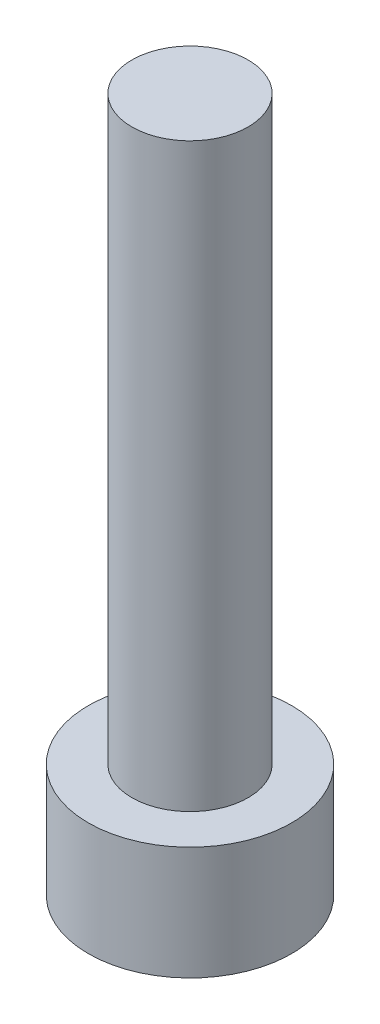
ISO-10303-21;
HEADER;
FILE_DESCRIPTION(('STEP AP214'),'2;1');
FILE_NAME('part.step','',(''),(''),'','','');
FILE_SCHEMA(('AUTOMOTIVE_DESIGN { 1 0 10303 214 1 1 1 1 }'));
ENDSEC;
DATA;
#1=APPLICATION_CONTEXT('core data for automotive mechanical design processes');
#2=APPLICATION_PROTOCOL_DEFINITION('international standard','automotive_design',2000,#1);
#3=PRODUCT_CONTEXT('',#1,'mechanical');
#4=PRODUCT('Part','Part','',(#3));
#5=PRODUCT_RELATED_PRODUCT_CATEGORY('part','',(#4));
#6=PRODUCT_DEFINITION_FORMATION('','',#4);
#7=PRODUCT_DEFINITION_CONTEXT('part definition',#1,'design');
#8=PRODUCT_DEFINITION('design','',#6,#7);
#9=PRODUCT_DEFINITION_SHAPE('','',#8);
#10=(LENGTH_UNIT() NAMED_UNIT(*) SI_UNIT(.MILLI.,.METRE.));
#11=(NAMED_UNIT(*) PLANE_ANGLE_UNIT() SI_UNIT($,.RADIAN.));
#12=(NAMED_UNIT(*) SI_UNIT($,.STERADIAN.) SOLID_ANGLE_UNIT());
#13=UNCERTAINTY_MEASURE_WITH_UNIT(LENGTH_MEASURE(1.E-05),#10,'distance_accuracy_value','');
#14=(GEOMETRIC_REPRESENTATION_CONTEXT(3) GLOBAL_UNCERTAINTY_ASSIGNED_CONTEXT((#13)) GLOBAL_UNIT_ASSIGNED_CONTEXT((#10,
#11,#12)) REPRESENTATION_CONTEXT('',''));
#15=CARTESIAN_POINT('',(0.,0.,0.));
#16=DIRECTION('',(0.,0.,1.));
#17=DIRECTION('',(1.,0.,0.));
#18=AXIS2_PLACEMENT_3D('',#15,#16,#17);
#19=CARTESIAN_POINT('',(0.,3.9,0.));
#20=DIRECTION('',(0.,-1.,0.));
#21=DIRECTION('',(0.,0.,-1.));
#22=AXIS2_PLACEMENT_3D('',#19,#20,#21);
#23=CYLINDRICAL_SURFACE('',#22,3.5);
#24=CARTESIAN_POINT('',(0.,3.9,0.));
#25=DIRECTION('',(0.,1.,0.));
#26=DIRECTION('',(0.,0.,1.));
#27=AXIS2_PLACEMENT_3D('',#24,#25,#26);
#28=CIRCLE('',#27,3.5);
#29=CARTESIAN_POINT('',(0.,3.9,3.5));
#30=VERTEX_POINT('',#29);
#31=EDGE_CURVE('E43',#30,#30,#28,.T.);
#32=ORIENTED_EDGE('',*,*,#31,.F.);
#33=EDGE_LOOP('',(#32));
#34=FACE_BOUND('',#33,.T.);
#35=CARTESIAN_POINT('',(0.,0.,0.));
#36=DIRECTION('',(0.,1.,0.));
#37=DIRECTION('',(0.,0.,1.));
#38=AXIS2_PLACEMENT_3D('',#35,#36,#37);
#39=CIRCLE('',#38,3.5);
#40=CARTESIAN_POINT('',(0.,0.,3.5));
#41=VERTEX_POINT('',#40);
#42=EDGE_CURVE('E38',#41,#41,#39,.T.);
#43=ORIENTED_EDGE('',*,*,#42,.T.);
#44=EDGE_LOOP('',(#43));
#45=FACE_BOUND('',#44,.T.);
#46=ADVANCED_FACE('F35',(#34,#45),#23,.T.);
#47=CARTESIAN_POINT('',(0.,3.9,0.));
#48=DIRECTION('',(0.,1.,0.));
#49=DIRECTION('',(0.,0.,1.));
#50=AXIS2_PLACEMENT_3D('',#47,#48,#49);
#51=PLANE('',#50);
#52=CARTESIAN_POINT('',(0.,3.9,0.));
#53=DIRECTION('',(0.,1.,0.));
#54=DIRECTION('',(0.,0.,1.));
#55=AXIS2_PLACEMENT_3D('',#52,#53,#54);
#56=CIRCLE('',#55,2.);
#57=CARTESIAN_POINT('',(0.,3.9,2.));
#58=VERTEX_POINT('',#57);
#59=EDGE_CURVE('E11',#58,#58,#56,.T.);
#60=ORIENTED_EDGE('',*,*,#59,.F.);
#61=EDGE_LOOP('',(#60));
#62=FACE_BOUND('',#61,.T.);
#63=ORIENTED_EDGE('',*,*,#31,.T.);
#64=EDGE_LOOP('',(#63));
#65=FACE_BOUND('',#64,.T.);
#66=ADVANCED_FACE('F155',(#62,#65),#51,.T.);
#67=CARTESIAN_POINT('',(0.,0.,0.));
#68=DIRECTION('',(0.,1.,0.));
#69=DIRECTION('',(0.,0.,1.));
#70=AXIS2_PLACEMENT_3D('',#67,#68,#69);
#71=PLANE('',#70);
#72=DIRECTION('',(-0.5,0.,0.866025403784438));
#73=VECTOR('',#72,1.);
#74=CARTESIAN_POINT('',(1.725,0.,0.));
#75=LINE('',#74,#73);
#76=CARTESIAN_POINT('',(1.725,0.,0.));
#77=VERTEX_POINT('',#76);
#78=CARTESIAN_POINT('',(0.862499999999999,0.,1.49389382152816));
#79=VERTEX_POINT('',#78);
#80=EDGE_CURVE('E125',#77,#79,#75,.T.);
#81=ORIENTED_EDGE('',*,*,#80,.F.);
#82=DIRECTION('',(0.5,0.,0.866025403784439));
#83=VECTOR('',#82,1.);
#84=CARTESIAN_POINT('',(0.8625,0.,-1.49389382152816));
#85=LINE('',#84,#83);
#86=CARTESIAN_POINT('',(0.8625,0.,-1.49389382152816));
#87=VERTEX_POINT('',#86);
#88=EDGE_CURVE('E51',#87,#77,#85,.T.);
#89=ORIENTED_EDGE('',*,*,#88,.F.);
#90=DIRECTION('',(1.,0.,0.));
#91=VECTOR('',#90,1.);
#92=CARTESIAN_POINT('',(-0.8625,0.,-1.49389382152816));
#93=LINE('',#92,#91);
#94=CARTESIAN_POINT('',(-0.8625,0.,-1.49389382152816));
#95=VERTEX_POINT('',#94);
#96=EDGE_CURVE('E134',#95,#87,#93,.T.);
#97=ORIENTED_EDGE('',*,*,#96,.F.);
#98=DIRECTION('',(0.5,0.,-0.866025403784439));
#99=VECTOR('',#98,1.);
#100=CARTESIAN_POINT('',(-1.725,0.,0.));
#101=LINE('',#100,#99);
#102=CARTESIAN_POINT('',(-1.725,0.,0.));
#103=VERTEX_POINT('',#102);
#104=EDGE_CURVE('E132',#103,#95,#101,.T.);
#105=ORIENTED_EDGE('',*,*,#104,.F.);
#106=DIRECTION('',(-0.5,0.,-0.866025403784439));
#107=VECTOR('',#106,1.);
#108=CARTESIAN_POINT('',(-0.8625,0.,1.49389382152816));
#109=LINE('',#108,#107);
#110=CARTESIAN_POINT('',(-0.8625,0.,1.49389382152816));
#111=VERTEX_POINT('',#110);
#112=EDGE_CURVE('E99',#111,#103,#109,.T.);
#113=ORIENTED_EDGE('',*,*,#112,.F.);
#114=DIRECTION('',(-1.,0.,0.));
#115=VECTOR('',#114,1.);
#116=CARTESIAN_POINT('',(0.862499999999999,0.,1.49389382152816));
#117=LINE('',#116,#115);
#118=EDGE_CURVE('E128',#79,#111,#117,.T.);
#119=ORIENTED_EDGE('',*,*,#118,.F.);
#120=EDGE_LOOP('',(#81,#89,#97,#105,#113,#119));
#121=FACE_BOUND('',#120,.T.);
#122=ORIENTED_EDGE('',*,*,#42,.F.);
#123=EDGE_LOOP('',(#122));
#124=FACE_BOUND('',#123,.T.);
#125=ADVANCED_FACE('F152',(#121,#124),#71,.F.);
#126=CARTESIAN_POINT('',(0.,23.9,0.));
#127=DIRECTION('',(0.,-1.,0.));
#128=DIRECTION('',(0.,0.,-1.));
#129=AXIS2_PLACEMENT_3D('',#126,#127,#128);
#130=CYLINDRICAL_SURFACE('',#129,2.);
#131=CARTESIAN_POINT('',(0.,23.9,0.));
#132=DIRECTION('',(0.,1.,0.));
#133=DIRECTION('',(0.,0.,1.));
#134=AXIS2_PLACEMENT_3D('',#131,#132,#133);
#135=CIRCLE('',#134,2.);
#136=CARTESIAN_POINT('',(0.,23.9,2.));
#137=VERTEX_POINT('',#136);
#138=EDGE_CURVE('E138',#137,#137,#135,.T.);
#139=ORIENTED_EDGE('',*,*,#138,.F.);
#140=EDGE_LOOP('',(#139));
#141=FACE_BOUND('',#140,.T.);
#142=ORIENTED_EDGE('',*,*,#59,.T.);
#143=EDGE_LOOP('',(#142));
#144=FACE_BOUND('',#143,.T.);
#145=ADVANCED_FACE('F154',(#141,#144),#130,.T.);
#146=CARTESIAN_POINT('',(0.,23.9,0.));
#147=DIRECTION('',(0.,1.,0.));
#148=DIRECTION('',(0.,0.,1.));
#149=AXIS2_PLACEMENT_3D('',#146,#147,#148);
#150=PLANE('',#149);
#151=ORIENTED_EDGE('',*,*,#138,.T.);
#152=EDGE_LOOP('',(#151));
#153=FACE_BOUND('',#152,.T.);
#154=ADVANCED_FACE('F161',(#153),#150,.T.);
#155=CARTESIAN_POINT('',(0.8625,2.4,-1.49389382152816));
#156=DIRECTION('',(0.866025403784439,0.,-0.5));
#157=DIRECTION('',(-0.5,0.,-0.866025403784439));
#158=AXIS2_PLACEMENT_3D('',#155,#156,#157);
#159=PLANE('',#158);
#160=ORIENTED_EDGE('',*,*,#88,.T.);
#161=DIRECTION('',(0.,-1.,0.));
#162=VECTOR('',#161,1.);
#163=CARTESIAN_POINT('',(1.725,2.4,0.));
#164=LINE('',#163,#162);
#165=CARTESIAN_POINT('',(1.725,2.4,0.));
#166=VERTEX_POINT('',#165);
#167=EDGE_CURVE('E81',#166,#77,#164,.T.);
#168=ORIENTED_EDGE('',*,*,#167,.F.);
#169=DIRECTION('',(0.5,0.,0.866025403784439));
#170=VECTOR('',#169,1.);
#171=CARTESIAN_POINT('',(0.8625,2.4,-1.49389382152816));
#172=LINE('',#171,#170);
#173=CARTESIAN_POINT('',(0.8625,2.4,-1.49389382152816));
#174=VERTEX_POINT('',#173);
#175=EDGE_CURVE('E136',#174,#166,#172,.T.);
#176=ORIENTED_EDGE('',*,*,#175,.F.);
#177=DIRECTION('',(0.,-1.,0.));
#178=VECTOR('',#177,1.);
#179=CARTESIAN_POINT('',(0.8625,2.4,-1.49389382152816));
#180=LINE('',#179,#178);
#181=EDGE_CURVE('E59',#174,#87,#180,.T.);
#182=ORIENTED_EDGE('',*,*,#181,.T.);
#183=EDGE_LOOP('',(#160,#168,#176,#182));
#184=FACE_BOUND('',#183,.T.);
#185=ADVANCED_FACE('F190',(#184),#159,.F.);
#186=CARTESIAN_POINT('',(-0.8625,2.4,-1.49389382152816));
#187=DIRECTION('',(0.,0.,-1.));
#188=DIRECTION('',(-1.,0.,0.));
#189=AXIS2_PLACEMENT_3D('',#186,#187,#188);
#190=PLANE('',#189);
#191=ORIENTED_EDGE('',*,*,#96,.T.);
#192=ORIENTED_EDGE('',*,*,#181,.F.);
#193=DIRECTION('',(1.,0.,0.));
#194=VECTOR('',#193,1.);
#195=CARTESIAN_POINT('',(-0.8625,2.4,-1.49389382152816));
#196=LINE('',#195,#194);
#197=CARTESIAN_POINT('',(-0.8625,2.4,-1.49389382152816));
#198=VERTEX_POINT('',#197);
#199=EDGE_CURVE('E111',#198,#174,#196,.T.);
#200=ORIENTED_EDGE('',*,*,#199,.F.);
#201=DIRECTION('',(0.,-1.,0.));
#202=VECTOR('',#201,1.);
#203=CARTESIAN_POINT('',(-0.8625,2.4,-1.49389382152816));
#204=LINE('',#203,#202);
#205=EDGE_CURVE('E103',#198,#95,#204,.T.);
#206=ORIENTED_EDGE('',*,*,#205,.T.);
#207=EDGE_LOOP('',(#191,#192,#200,#206));
#208=FACE_BOUND('',#207,.T.);
#209=ADVANCED_FACE('F204',(#208),#190,.F.);
#210=CARTESIAN_POINT('',(-1.725,2.4,0.));
#211=DIRECTION('',(-0.866025403784439,0.,-0.5));
#212=DIRECTION('',(-0.5,0.,0.866025403784439));
#213=AXIS2_PLACEMENT_3D('',#210,#211,#212);
#214=PLANE('',#213);
#215=ORIENTED_EDGE('',*,*,#104,.T.);
#216=ORIENTED_EDGE('',*,*,#205,.F.);
#217=DIRECTION('',(0.5,0.,-0.866025403784439));
#218=VECTOR('',#217,1.);
#219=CARTESIAN_POINT('',(-1.725,2.4,0.));
#220=LINE('',#219,#218);
#221=CARTESIAN_POINT('',(-1.725,2.4,0.));
#222=VERTEX_POINT('',#221);
#223=EDGE_CURVE('E107',#222,#198,#220,.T.);
#224=ORIENTED_EDGE('',*,*,#223,.F.);
#225=DIRECTION('',(0.,-1.,0.));
#226=VECTOR('',#225,1.);
#227=CARTESIAN_POINT('',(-1.725,2.4,0.));
#228=LINE('',#227,#226);
#229=EDGE_CURVE('E92',#222,#103,#228,.T.);
#230=ORIENTED_EDGE('',*,*,#229,.T.);
#231=EDGE_LOOP('',(#215,#216,#224,#230));
#232=FACE_BOUND('',#231,.T.);
#233=ADVANCED_FACE('F108',(#232),#214,.F.);
#234=CARTESIAN_POINT('',(-0.8625,2.4,1.49389382152816));
#235=DIRECTION('',(-0.866025403784439,0.,0.5));
#236=DIRECTION('',(0.5,0.,0.866025403784439));
#237=AXIS2_PLACEMENT_3D('',#234,#235,#236);
#238=PLANE('',#237);
#239=ORIENTED_EDGE('',*,*,#112,.T.);
#240=ORIENTED_EDGE('',*,*,#229,.F.);
#241=DIRECTION('',(-0.5,0.,-0.866025403784439));
#242=VECTOR('',#241,1.);
#243=CARTESIAN_POINT('',(-0.8625,2.4,1.49389382152816));
#244=LINE('',#243,#242);
#245=CARTESIAN_POINT('',(-0.8625,2.4,1.49389382152816));
#246=VERTEX_POINT('',#245);
#247=EDGE_CURVE('E96',#246,#222,#244,.T.);
#248=ORIENTED_EDGE('',*,*,#247,.F.);
#249=DIRECTION('',(0.,-1.,0.));
#250=VECTOR('',#249,1.);
#251=CARTESIAN_POINT('',(-0.8625,2.4,1.49389382152816));
#252=LINE('',#251,#250);
#253=EDGE_CURVE('E104',#246,#111,#252,.T.);
#254=ORIENTED_EDGE('',*,*,#253,.T.);
#255=EDGE_LOOP('',(#239,#240,#248,#254));
#256=FACE_BOUND('',#255,.T.);
#257=ADVANCED_FACE('F94',(#256),#238,.F.);
#258=CARTESIAN_POINT('',(0.862499999999999,2.4,1.49389382152816));
#259=DIRECTION('',(0.,0.,1.));
#260=DIRECTION('',(1.,0.,0.));
#261=AXIS2_PLACEMENT_3D('',#258,#259,#260);
#262=PLANE('',#261);
#263=ORIENTED_EDGE('',*,*,#118,.T.);
#264=ORIENTED_EDGE('',*,*,#253,.F.);
#265=DIRECTION('',(-1.,0.,0.));
#266=VECTOR('',#265,1.);
#267=CARTESIAN_POINT('',(0.862499999999999,2.4,1.49389382152816));
#268=LINE('',#267,#266);
#269=CARTESIAN_POINT('',(0.862499999999999,2.4,1.49389382152816));
#270=VERTEX_POINT('',#269);
#271=EDGE_CURVE('E117',#270,#246,#268,.T.);
#272=ORIENTED_EDGE('',*,*,#271,.F.);
#273=DIRECTION('',(0.,-1.,0.));
#274=VECTOR('',#273,1.);
#275=CARTESIAN_POINT('',(0.862499999999999,2.4,1.49389382152816));
#276=LINE('',#275,#274);
#277=EDGE_CURVE('E141',#270,#79,#276,.T.);
#278=ORIENTED_EDGE('',*,*,#277,.T.);
#279=EDGE_LOOP('',(#263,#264,#272,#278));
#280=FACE_BOUND('',#279,.T.);
#281=ADVANCED_FACE('F229',(#280),#262,.F.);
#282=CARTESIAN_POINT('',(1.725,2.4,0.));
#283=DIRECTION('',(0.866025403784439,0.,0.5));
#284=DIRECTION('',(0.5,0.,-0.866025403784439));
#285=AXIS2_PLACEMENT_3D('',#282,#283,#284);
#286=PLANE('',#285);
#287=ORIENTED_EDGE('',*,*,#80,.T.);
#288=ORIENTED_EDGE('',*,*,#277,.F.);
#289=DIRECTION('',(-0.5,0.,0.866025403784438));
#290=VECTOR('',#289,1.);
#291=CARTESIAN_POINT('',(1.725,2.4,0.));
#292=LINE('',#291,#290);
#293=EDGE_CURVE('E119',#166,#270,#292,.T.);
#294=ORIENTED_EDGE('',*,*,#293,.F.);
#295=ORIENTED_EDGE('',*,*,#167,.T.);
#296=EDGE_LOOP('',(#287,#288,#294,#295));
#297=FACE_BOUND('',#296,.T.);
#298=ADVANCED_FACE('F238',(#297),#286,.F.);
#299=CARTESIAN_POINT('',(0.,2.4,0.));
#300=DIRECTION('',(0.,-1.,0.));
#301=DIRECTION('',(0.,0.,-1.));
#302=AXIS2_PLACEMENT_3D('',#299,#300,#301);
#303=PLANE('',#302);
#304=ORIENTED_EDGE('',*,*,#175,.T.);
#305=ORIENTED_EDGE('',*,*,#293,.T.);
#306=ORIENTED_EDGE('',*,*,#271,.T.);
#307=ORIENTED_EDGE('',*,*,#247,.T.);
#308=ORIENTED_EDGE('',*,*,#223,.T.);
#309=ORIENTED_EDGE('',*,*,#199,.T.);
#310=EDGE_LOOP('',(#304,#305,#306,#307,#308,#309));
#311=FACE_BOUND('',#310,.T.);
#312=ADVANCED_FACE('F114',(#311),#303,.T.);
#313=CLOSED_SHELL('',(#46,#66,#125,#145,#154,#185,#209,#233,#257,#281,#298,#312));
#314=MANIFOLD_SOLID_BREP('B2',#313);
#315=ADVANCED_BREP_SHAPE_REPRESENTATION('',(#18,#314),#14);
#316=SHAPE_DEFINITION_REPRESENTATION(#9,#315);
ENDSEC;
END-ISO-10303-21;
